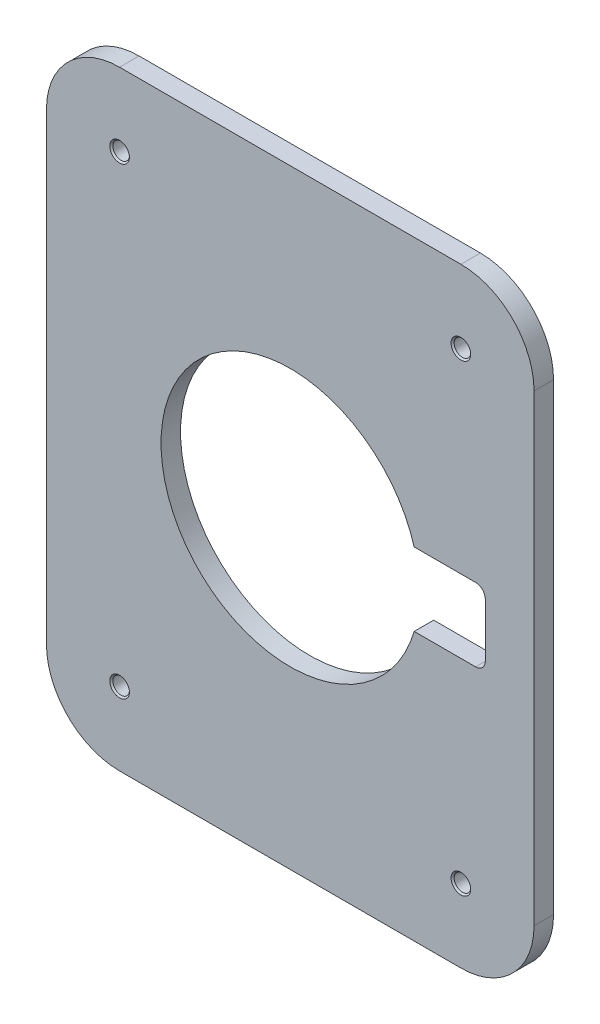
ISO-10303-21;
HEADER;
FILE_DESCRIPTION(('STEP AP214'),'2;1');
FILE_NAME('part.step','',(''),(''),'','','');
FILE_SCHEMA(('AUTOMOTIVE_DESIGN { 1 0 10303 214 1 1 1 1 }'));
ENDSEC;
DATA;
#1=APPLICATION_CONTEXT('core data for automotive mechanical design processes');
#2=APPLICATION_PROTOCOL_DEFINITION('international standard','automotive_design',2000,#1);
#3=PRODUCT_CONTEXT('',#1,'mechanical');
#4=PRODUCT('Part','Part','',(#3));
#5=PRODUCT_RELATED_PRODUCT_CATEGORY('part','',(#4));
#6=PRODUCT_DEFINITION_FORMATION('','',#4);
#7=PRODUCT_DEFINITION_CONTEXT('part definition',#1,'design');
#8=PRODUCT_DEFINITION('design','',#6,#7);
#9=PRODUCT_DEFINITION_SHAPE('','',#8);
#10=(LENGTH_UNIT() NAMED_UNIT(*) SI_UNIT(.MILLI.,.METRE.));
#11=(NAMED_UNIT(*) PLANE_ANGLE_UNIT() SI_UNIT($,.RADIAN.));
#12=(NAMED_UNIT(*) SI_UNIT($,.STERADIAN.) SOLID_ANGLE_UNIT());
#13=UNCERTAINTY_MEASURE_WITH_UNIT(LENGTH_MEASURE(1.E-05),#10,'distance_accuracy_value','');
#14=(GEOMETRIC_REPRESENTATION_CONTEXT(3) GLOBAL_UNCERTAINTY_ASSIGNED_CONTEXT((#13)) GLOBAL_UNIT_ASSIGNED_CONTEXT((#10,
#11,#12)) REPRESENTATION_CONTEXT('',''));
#15=CARTESIAN_POINT('',(0.,0.,0.));
#16=DIRECTION('',(0.,0.,1.));
#17=DIRECTION('',(1.,0.,0.));
#18=AXIS2_PLACEMENT_3D('',#15,#16,#17);
#19=CARTESIAN_POINT('',(0.,0.,0.));
#20=DIRECTION('',(0.,0.,1.));
#21=DIRECTION('',(1.,0.,0.));
#22=AXIS2_PLACEMENT_3D('',#19,#20,#21);
#23=PLANE('',#22);
#24=CARTESIAN_POINT('',(70.,95.,0.));
#25=DIRECTION('',(0.,0.,-1.));
#26=DIRECTION('',(-1.,0.,0.));
#27=AXIS2_PLACEMENT_3D('',#24,#25,#26);
#28=CIRCLE('',#27,4.025);
#29=CARTESIAN_POINT('',(65.975,95.,0.));
#30=VERTEX_POINT('',#29);
#31=EDGE_CURVE('E616',#30,#30,#28,.T.);
#32=ORIENTED_EDGE('',*,*,#31,.F.);
#33=EDGE_LOOP('',(#32));
#34=FACE_BOUND('',#33,.T.);
#35=CARTESIAN_POINT('',(-70.,95.,0.));
#36=DIRECTION('',(0.,0.,-1.));
#37=DIRECTION('',(-1.,0.,0.));
#38=AXIS2_PLACEMENT_3D('',#35,#36,#37);
#39=CIRCLE('',#38,4.025);
#40=CARTESIAN_POINT('',(-74.025,95.,0.));
#41=VERTEX_POINT('',#40);
#42=EDGE_CURVE('E634',#41,#41,#39,.T.);
#43=ORIENTED_EDGE('',*,*,#42,.F.);
#44=EDGE_LOOP('',(#43));
#45=FACE_BOUND('',#44,.T.);
#46=CARTESIAN_POINT('',(-70.,-95.,0.));
#47=DIRECTION('',(0.,0.,-1.));
#48=DIRECTION('',(-1.,0.,0.));
#49=AXIS2_PLACEMENT_3D('',#46,#47,#48);
#50=CIRCLE('',#49,4.025);
#51=CARTESIAN_POINT('',(-74.025,-95.,0.));
#52=VERTEX_POINT('',#51);
#53=EDGE_CURVE('E650',#52,#52,#50,.T.);
#54=ORIENTED_EDGE('',*,*,#53,.F.);
#55=EDGE_LOOP('',(#54));
#56=FACE_BOUND('',#55,.T.);
#57=DIRECTION('',(-1.,0.,0.));
#58=VECTOR('',#57,1.);
#59=CARTESIAN_POINT('',(-100.,125.,0.));
#60=LINE('',#59,#58);
#61=CARTESIAN_POINT('',(70.,125.,0.));
#62=VERTEX_POINT('',#61);
#63=CARTESIAN_POINT('',(-70.,125.,0.));
#64=VERTEX_POINT('',#63);
#65=EDGE_CURVE('E219',#62,#64,#60,.T.);
#66=ORIENTED_EDGE('',*,*,#65,.F.);
#67=CARTESIAN_POINT('',(70.,95.,0.));
#68=DIRECTION('',(0.,0.,1.));
#69=DIRECTION('',(1.,0.,0.));
#70=AXIS2_PLACEMENT_3D('',#67,#68,#69);
#71=CIRCLE('',#70,30.);
#72=CARTESIAN_POINT('',(100.,95.,0.));
#73=VERTEX_POINT('',#72);
#74=EDGE_CURVE('E245',#62,#73,#71,.F.);
#75=ORIENTED_EDGE('',*,*,#74,.T.);
#76=DIRECTION('',(0.,1.,0.));
#77=VECTOR('',#76,1.);
#78=CARTESIAN_POINT('',(100.,125.,0.));
#79=LINE('',#78,#77);
#80=CARTESIAN_POINT('',(100.,-95.,0.));
#81=VERTEX_POINT('',#80);
#82=EDGE_CURVE('E168',#81,#73,#79,.T.);
#83=ORIENTED_EDGE('',*,*,#82,.F.);
#84=CARTESIAN_POINT('',(70.,-95.,0.));
#85=DIRECTION('',(0.,0.,1.));
#86=DIRECTION('',(1.,0.,0.));
#87=AXIS2_PLACEMENT_3D('',#84,#85,#86);
#88=CIRCLE('',#87,30.);
#89=CARTESIAN_POINT('',(70.,-125.,0.));
#90=VERTEX_POINT('',#89);
#91=EDGE_CURVE('E236',#81,#90,#88,.F.);
#92=ORIENTED_EDGE('',*,*,#91,.T.);
#93=DIRECTION('',(1.,0.,0.));
#94=VECTOR('',#93,1.);
#95=CARTESIAN_POINT('',(-100.,-125.,0.));
#96=LINE('',#95,#94);
#97=CARTESIAN_POINT('',(-70.,-125.,0.));
#98=VERTEX_POINT('',#97);
#99=EDGE_CURVE('E203',#98,#90,#96,.T.);
#100=ORIENTED_EDGE('',*,*,#99,.F.);
#101=CARTESIAN_POINT('',(-70.,-95.,0.));
#102=DIRECTION('',(0.,0.,1.));
#103=DIRECTION('',(1.,0.,0.));
#104=AXIS2_PLACEMENT_3D('',#101,#102,#103);
#105=CIRCLE('',#104,30.);
#106=CARTESIAN_POINT('',(-100.,-95.,0.));
#107=VERTEX_POINT('',#106);
#108=EDGE_CURVE('E239',#98,#107,#105,.F.);
#109=ORIENTED_EDGE('',*,*,#108,.T.);
#110=DIRECTION('',(0.,-1.,0.));
#111=VECTOR('',#110,1.);
#112=CARTESIAN_POINT('',(-100.,125.,0.));
#113=LINE('',#112,#111);
#114=CARTESIAN_POINT('',(-100.,95.,0.));
#115=VERTEX_POINT('',#114);
#116=EDGE_CURVE('E223',#115,#107,#113,.T.);
#117=ORIENTED_EDGE('',*,*,#116,.F.);
#118=CARTESIAN_POINT('',(-70.,95.,0.));
#119=DIRECTION('',(0.,0.,1.));
#120=DIRECTION('',(1.,0.,0.));
#121=AXIS2_PLACEMENT_3D('',#118,#119,#120);
#122=CIRCLE('',#121,30.);
#123=EDGE_CURVE('E242',#115,#64,#122,.F.);
#124=ORIENTED_EDGE('',*,*,#123,.T.);
#125=EDGE_LOOP('',(#66,#75,#83,#92,#100,#109,#117,#124));
#126=FACE_BOUND('',#125,.T.);
#127=CARTESIAN_POINT('',(0.,0.,0.));
#128=DIRECTION('',(0.,0.,1.));
#129=DIRECTION('',(1.,0.,0.));
#130=AXIS2_PLACEMENT_3D('',#127,#128,#129);
#131=CIRCLE('',#130,53.);
#132=CARTESIAN_POINT('',(50.8330601085554,15.,0.));
#133=VERTEX_POINT('',#132);
#134=CARTESIAN_POINT('',(50.8330601085554,-15.,0.));
#135=VERTEX_POINT('',#134);
#136=EDGE_CURVE('E185',#133,#135,#131,.T.);
#137=ORIENTED_EDGE('',*,*,#136,.T.);
#138=DIRECTION('',(1.,0.,0.));
#139=VECTOR('',#138,1.);
#140=CARTESIAN_POINT('',(80.,-15.,0.));
#141=LINE('',#140,#139);
#142=CARTESIAN_POINT('',(76.,-15.,0.));
#143=VERTEX_POINT('',#142);
#144=EDGE_CURVE('E166',#135,#143,#141,.T.);
#145=ORIENTED_EDGE('',*,*,#144,.T.);
#146=CARTESIAN_POINT('',(76.,-11.,0.));
#147=DIRECTION('',(0.,0.,1.));
#148=DIRECTION('',(1.,0.,0.));
#149=AXIS2_PLACEMENT_3D('',#146,#147,#148);
#150=CIRCLE('',#149,4.);
#151=CARTESIAN_POINT('',(80.,-11.,0.));
#152=VERTEX_POINT('',#151);
#153=EDGE_CURVE('E293',#143,#152,#150,.T.);
#154=ORIENTED_EDGE('',*,*,#153,.T.);
#155=DIRECTION('',(0.,1.,0.));
#156=VECTOR('',#155,1.);
#157=CARTESIAN_POINT('',(80.,15.,0.));
#158=LINE('',#157,#156);
#159=CARTESIAN_POINT('',(80.,11.,0.));
#160=VERTEX_POINT('',#159);
#161=EDGE_CURVE('E191',#152,#160,#158,.T.);
#162=ORIENTED_EDGE('',*,*,#161,.T.);
#163=CARTESIAN_POINT('',(76.,11.,0.));
#164=DIRECTION('',(0.,0.,1.));
#165=DIRECTION('',(1.,0.,0.));
#166=AXIS2_PLACEMENT_3D('',#163,#164,#165);
#167=CIRCLE('',#166,4.);
#168=CARTESIAN_POINT('',(76.,15.,0.));
#169=VERTEX_POINT('',#168);
#170=EDGE_CURVE('E54',#160,#169,#167,.T.);
#171=ORIENTED_EDGE('',*,*,#170,.T.);
#172=DIRECTION('',(-1.,0.,0.));
#173=VECTOR('',#172,1.);
#174=CARTESIAN_POINT('',(50.8330601085554,15.,0.));
#175=LINE('',#174,#173);
#176=EDGE_CURVE('E158',#169,#133,#175,.T.);
#177=ORIENTED_EDGE('',*,*,#176,.T.);
#178=EDGE_LOOP('',(#137,#145,#154,#162,#171,#177));
#179=FACE_BOUND('',#178,.T.);
#180=CARTESIAN_POINT('',(70.,-95.,0.));
#181=DIRECTION('',(0.,0.,-1.));
#182=DIRECTION('',(-1.,0.,0.));
#183=AXIS2_PLACEMENT_3D('',#180,#181,#182);
#184=CIRCLE('',#183,4.025);
#185=CARTESIAN_POINT('',(65.975,-95.,0.));
#186=VERTEX_POINT('',#185);
#187=EDGE_CURVE('E666',#186,#186,#184,.T.);
#188=ORIENTED_EDGE('',*,*,#187,.F.);
#189=EDGE_LOOP('',(#188));
#190=FACE_BOUND('',#189,.T.);
#191=ADVANCED_FACE('F45',(#34,#45,#56,#126,#179,#190),#23,.F.);
#192=CARTESIAN_POINT('',(0.,0.,8.));
#193=DIRECTION('',(0.,0.,1.));
#194=DIRECTION('',(1.,0.,0.));
#195=AXIS2_PLACEMENT_3D('',#192,#193,#194);
#196=PLANE('',#195);
#197=CARTESIAN_POINT('',(70.,95.,8.));
#198=DIRECTION('',(0.,0.,-1.));
#199=DIRECTION('',(-1.,0.,0.));
#200=AXIS2_PLACEMENT_3D('',#197,#198,#199);
#201=CIRCLE('',#200,4.025);
#202=CARTESIAN_POINT('',(65.975,95.,8.));
#203=VERTEX_POINT('',#202);
#204=EDGE_CURVE('E618',#203,#203,#201,.T.);
#205=ORIENTED_EDGE('',*,*,#204,.T.);
#206=EDGE_LOOP('',(#205));
#207=FACE_BOUND('',#206,.T.);
#208=CARTESIAN_POINT('',(-70.,95.,8.));
#209=DIRECTION('',(0.,0.,-1.));
#210=DIRECTION('',(-1.,0.,0.));
#211=AXIS2_PLACEMENT_3D('',#208,#209,#210);
#212=CIRCLE('',#211,4.025);
#213=CARTESIAN_POINT('',(-74.025,95.,8.));
#214=VERTEX_POINT('',#213);
#215=EDGE_CURVE('E630',#214,#214,#212,.T.);
#216=ORIENTED_EDGE('',*,*,#215,.T.);
#217=EDGE_LOOP('',(#216));
#218=FACE_BOUND('',#217,.T.);
#219=CARTESIAN_POINT('',(-70.,-95.,8.));
#220=DIRECTION('',(0.,0.,-1.));
#221=DIRECTION('',(-1.,0.,0.));
#222=AXIS2_PLACEMENT_3D('',#219,#220,#221);
#223=CIRCLE('',#222,4.025);
#224=CARTESIAN_POINT('',(-74.025,-95.,8.));
#225=VERTEX_POINT('',#224);
#226=EDGE_CURVE('E646',#225,#225,#223,.T.);
#227=ORIENTED_EDGE('',*,*,#226,.T.);
#228=EDGE_LOOP('',(#227));
#229=FACE_BOUND('',#228,.T.);
#230=CARTESIAN_POINT('',(70.,-95.,8.));
#231=DIRECTION('',(0.,0.,-1.));
#232=DIRECTION('',(-1.,0.,0.));
#233=AXIS2_PLACEMENT_3D('',#230,#231,#232);
#234=CIRCLE('',#233,4.025);
#235=CARTESIAN_POINT('',(65.975,-95.,8.));
#236=VERTEX_POINT('',#235);
#237=EDGE_CURVE('E662',#236,#236,#234,.T.);
#238=ORIENTED_EDGE('',*,*,#237,.T.);
#239=EDGE_LOOP('',(#238));
#240=FACE_BOUND('',#239,.T.);
#241=DIRECTION('',(0.,1.,0.));
#242=VECTOR('',#241,1.);
#243=CARTESIAN_POINT('',(100.,125.,8.));
#244=LINE('',#243,#242);
#245=CARTESIAN_POINT('',(100.,-95.,8.));
#246=VERTEX_POINT('',#245);
#247=CARTESIAN_POINT('',(100.,95.,8.));
#248=VERTEX_POINT('',#247);
#249=EDGE_CURVE('E198',#246,#248,#244,.T.);
#250=ORIENTED_EDGE('',*,*,#249,.T.);
#251=CARTESIAN_POINT('',(70.,95.,8.));
#252=DIRECTION('',(0.,0.,1.));
#253=DIRECTION('',(1.,0.,0.));
#254=AXIS2_PLACEMENT_3D('',#251,#252,#253);
#255=CIRCLE('',#254,30.);
#256=CARTESIAN_POINT('',(70.,125.,8.));
#257=VERTEX_POINT('',#256);
#258=EDGE_CURVE('E264',#248,#257,#255,.T.);
#259=ORIENTED_EDGE('',*,*,#258,.T.);
#260=DIRECTION('',(-1.,0.,0.));
#261=VECTOR('',#260,1.);
#262=CARTESIAN_POINT('',(-100.,125.,8.));
#263=LINE('',#262,#261);
#264=CARTESIAN_POINT('',(-70.,125.,8.));
#265=VERTEX_POINT('',#264);
#266=EDGE_CURVE('E202',#257,#265,#263,.T.);
#267=ORIENTED_EDGE('',*,*,#266,.T.);
#268=CARTESIAN_POINT('',(-70.,95.,8.));
#269=DIRECTION('',(0.,0.,1.));
#270=DIRECTION('',(1.,0.,0.));
#271=AXIS2_PLACEMENT_3D('',#268,#269,#270);
#272=CIRCLE('',#271,30.);
#273=CARTESIAN_POINT('',(-100.,95.,8.));
#274=VERTEX_POINT('',#273);
#275=EDGE_CURVE('E261',#265,#274,#272,.T.);
#276=ORIENTED_EDGE('',*,*,#275,.T.);
#277=DIRECTION('',(0.,-1.,0.));
#278=VECTOR('',#277,1.);
#279=CARTESIAN_POINT('',(-100.,125.,8.));
#280=LINE('',#279,#278);
#281=CARTESIAN_POINT('',(-100.,-95.,8.));
#282=VERTEX_POINT('',#281);
#283=EDGE_CURVE('E207',#274,#282,#280,.T.);
#284=ORIENTED_EDGE('',*,*,#283,.T.);
#285=CARTESIAN_POINT('',(-70.,-95.,8.));
#286=DIRECTION('',(0.,0.,1.));
#287=DIRECTION('',(1.,0.,0.));
#288=AXIS2_PLACEMENT_3D('',#285,#286,#287);
#289=CIRCLE('',#288,30.);
#290=CARTESIAN_POINT('',(-70.,-125.,8.));
#291=VERTEX_POINT('',#290);
#292=EDGE_CURVE('E258',#282,#291,#289,.T.);
#293=ORIENTED_EDGE('',*,*,#292,.T.);
#294=DIRECTION('',(1.,0.,0.));
#295=VECTOR('',#294,1.);
#296=CARTESIAN_POINT('',(-100.,-125.,8.));
#297=LINE('',#296,#295);
#298=CARTESIAN_POINT('',(70.,-125.,8.));
#299=VERTEX_POINT('',#298);
#300=EDGE_CURVE('E211',#291,#299,#297,.T.);
#301=ORIENTED_EDGE('',*,*,#300,.T.);
#302=CARTESIAN_POINT('',(70.,-95.,8.));
#303=DIRECTION('',(0.,0.,1.));
#304=DIRECTION('',(1.,0.,0.));
#305=AXIS2_PLACEMENT_3D('',#302,#303,#304);
#306=CIRCLE('',#305,30.);
#307=EDGE_CURVE('E255',#299,#246,#306,.T.);
#308=ORIENTED_EDGE('',*,*,#307,.T.);
#309=EDGE_LOOP('',(#250,#259,#267,#276,#284,#293,#301,#308));
#310=FACE_BOUND('',#309,.T.);
#311=DIRECTION('',(1.,0.,0.));
#312=VECTOR('',#311,1.);
#313=CARTESIAN_POINT('',(80.,-15.,8.));
#314=LINE('',#313,#312);
#315=CARTESIAN_POINT('',(50.8330601085554,-15.,8.));
#316=VERTEX_POINT('',#315);
#317=CARTESIAN_POINT('',(76.,-15.,8.));
#318=VERTEX_POINT('',#317);
#319=EDGE_CURVE('E157',#316,#318,#314,.T.);
#320=ORIENTED_EDGE('',*,*,#319,.F.);
#321=CARTESIAN_POINT('',(0.,0.,8.));
#322=DIRECTION('',(0.,0.,1.));
#323=DIRECTION('',(1.,0.,0.));
#324=AXIS2_PLACEMENT_3D('',#321,#322,#323);
#325=CIRCLE('',#324,53.);
#326=CARTESIAN_POINT('',(50.8330601085554,15.,8.));
#327=VERTEX_POINT('',#326);
#328=EDGE_CURVE('E146',#327,#316,#325,.T.);
#329=ORIENTED_EDGE('',*,*,#328,.F.);
#330=DIRECTION('',(-1.,0.,0.));
#331=VECTOR('',#330,1.);
#332=CARTESIAN_POINT('',(50.8330601085554,15.,8.));
#333=LINE('',#332,#331);
#334=CARTESIAN_POINT('',(76.,15.,8.));
#335=VERTEX_POINT('',#334);
#336=EDGE_CURVE('E179',#335,#327,#333,.T.);
#337=ORIENTED_EDGE('',*,*,#336,.F.);
#338=CARTESIAN_POINT('',(76.,11.,8.));
#339=DIRECTION('',(0.,0.,1.));
#340=DIRECTION('',(1.,0.,0.));
#341=AXIS2_PLACEMENT_3D('',#338,#339,#340);
#342=CIRCLE('',#341,4.);
#343=CARTESIAN_POINT('',(80.,11.,8.));
#344=VERTEX_POINT('',#343);
#345=EDGE_CURVE('E11',#335,#344,#342,.F.);
#346=ORIENTED_EDGE('',*,*,#345,.T.);
#347=DIRECTION('',(0.,1.,0.));
#348=VECTOR('',#347,1.);
#349=CARTESIAN_POINT('',(80.,15.,8.));
#350=LINE('',#349,#348);
#351=CARTESIAN_POINT('',(80.,-11.,8.));
#352=VERTEX_POINT('',#351);
#353=EDGE_CURVE('E175',#352,#344,#350,.T.);
#354=ORIENTED_EDGE('',*,*,#353,.F.);
#355=CARTESIAN_POINT('',(76.,-11.,8.));
#356=DIRECTION('',(0.,0.,1.));
#357=DIRECTION('',(1.,0.,0.));
#358=AXIS2_PLACEMENT_3D('',#355,#356,#357);
#359=CIRCLE('',#358,4.);
#360=EDGE_CURVE('E173',#352,#318,#359,.F.);
#361=ORIENTED_EDGE('',*,*,#360,.T.);
#362=EDGE_LOOP('',(#320,#329,#337,#346,#354,#361));
#363=FACE_BOUND('',#362,.T.);
#364=ADVANCED_FACE('F170',(#207,#218,#229,#240,#310,#363),#196,.T.);
#365=CARTESIAN_POINT('',(100.,125.,8.));
#366=DIRECTION('',(-1.,0.,0.));
#367=DIRECTION('',(0.,-1.,0.));
#368=AXIS2_PLACEMENT_3D('',#365,#366,#367);
#369=PLANE('',#368);
#370=ORIENTED_EDGE('',*,*,#82,.T.);
#371=DIRECTION('',(0.,0.,-1.));
#372=VECTOR('',#371,1.);
#373=CARTESIAN_POINT('',(100.,95.,8.));
#374=LINE('',#373,#372);
#375=EDGE_CURVE('E252',#73,#248,#374,.F.);
#376=ORIENTED_EDGE('',*,*,#375,.T.);
#377=ORIENTED_EDGE('',*,*,#249,.F.);
#378=DIRECTION('',(0.,0.,-1.));
#379=VECTOR('',#378,1.);
#380=CARTESIAN_POINT('',(100.,-95.,8.));
#381=LINE('',#380,#379);
#382=EDGE_CURVE('E248',#246,#81,#381,.T.);
#383=ORIENTED_EDGE('',*,*,#382,.T.);
#384=EDGE_LOOP('',(#370,#376,#377,#383));
#385=FACE_BOUND('',#384,.T.);
#386=ADVANCED_FACE('F323',(#385),#369,.F.);
#387=CARTESIAN_POINT('',(-100.,125.,8.));
#388=DIRECTION('',(0.,-1.,0.));
#389=DIRECTION('',(0.,0.,-1.));
#390=AXIS2_PLACEMENT_3D('',#387,#388,#389);
#391=PLANE('',#390);
#392=ORIENTED_EDGE('',*,*,#266,.F.);
#393=DIRECTION('',(0.,0.,-1.));
#394=VECTOR('',#393,1.);
#395=CARTESIAN_POINT('',(70.,125.,8.));
#396=LINE('',#395,#394);
#397=EDGE_CURVE('E232',#257,#62,#396,.T.);
#398=ORIENTED_EDGE('',*,*,#397,.T.);
#399=ORIENTED_EDGE('',*,*,#65,.T.);
#400=DIRECTION('',(0.,0.,-1.));
#401=VECTOR('',#400,1.);
#402=CARTESIAN_POINT('',(-70.,125.,8.));
#403=LINE('',#402,#401);
#404=EDGE_CURVE('E215',#64,#265,#403,.F.);
#405=ORIENTED_EDGE('',*,*,#404,.T.);
#406=EDGE_LOOP('',(#392,#398,#399,#405));
#407=FACE_BOUND('',#406,.T.);
#408=ADVANCED_FACE('F337',(#407),#391,.F.);
#409=CARTESIAN_POINT('',(-100.,125.,8.));
#410=DIRECTION('',(1.,0.,0.));
#411=DIRECTION('',(0.,1.,0.));
#412=AXIS2_PLACEMENT_3D('',#409,#410,#411);
#413=PLANE('',#412);
#414=ORIENTED_EDGE('',*,*,#283,.F.);
#415=DIRECTION('',(0.,0.,-1.));
#416=VECTOR('',#415,1.);
#417=CARTESIAN_POINT('',(-100.,95.,8.));
#418=LINE('',#417,#416);
#419=EDGE_CURVE('E270',#274,#115,#418,.T.);
#420=ORIENTED_EDGE('',*,*,#419,.T.);
#421=ORIENTED_EDGE('',*,*,#116,.T.);
#422=DIRECTION('',(0.,0.,-1.));
#423=VECTOR('',#422,1.);
#424=CARTESIAN_POINT('',(-100.,-95.,8.));
#425=LINE('',#424,#423);
#426=EDGE_CURVE('E267',#107,#282,#425,.F.);
#427=ORIENTED_EDGE('',*,*,#426,.T.);
#428=EDGE_LOOP('',(#414,#420,#421,#427));
#429=FACE_BOUND('',#428,.T.);
#430=ADVANCED_FACE('F333',(#429),#413,.F.);
#431=CARTESIAN_POINT('',(-100.,-125.,8.));
#432=DIRECTION('',(0.,1.,0.));
#433=DIRECTION('',(0.,0.,1.));
#434=AXIS2_PLACEMENT_3D('',#431,#432,#433);
#435=PLANE('',#434);
#436=ORIENTED_EDGE('',*,*,#300,.F.);
#437=DIRECTION('',(0.,0.,-1.));
#438=VECTOR('',#437,1.);
#439=CARTESIAN_POINT('',(-70.,-125.,8.));
#440=LINE('',#439,#438);
#441=EDGE_CURVE('E277',#291,#98,#440,.T.);
#442=ORIENTED_EDGE('',*,*,#441,.T.);
#443=ORIENTED_EDGE('',*,*,#99,.T.);
#444=DIRECTION('',(0.,0.,-1.));
#445=VECTOR('',#444,1.);
#446=CARTESIAN_POINT('',(70.,-125.,8.));
#447=LINE('',#446,#445);
#448=EDGE_CURVE('E274',#90,#299,#447,.F.);
#449=ORIENTED_EDGE('',*,*,#448,.T.);
#450=EDGE_LOOP('',(#436,#442,#443,#449));
#451=FACE_BOUND('',#450,.T.);
#452=ADVANCED_FACE('F330',(#451),#435,.F.);
#453=CARTESIAN_POINT('',(0.,0.,8.));
#454=DIRECTION('',(0.,0.,-1.));
#455=DIRECTION('',(-1.,0.,0.));
#456=AXIS2_PLACEMENT_3D('',#453,#454,#455);
#457=CYLINDRICAL_SURFACE('',#456,53.);
#458=ORIENTED_EDGE('',*,*,#136,.F.);
#459=DIRECTION('',(0.,0.,-1.));
#460=VECTOR('',#459,1.);
#461=CARTESIAN_POINT('',(50.8330601085554,15.,8.));
#462=LINE('',#461,#460);
#463=EDGE_CURVE('E153',#327,#133,#462,.T.);
#464=ORIENTED_EDGE('',*,*,#463,.F.);
#465=ORIENTED_EDGE('',*,*,#328,.T.);
#466=DIRECTION('',(0.,0.,-1.));
#467=VECTOR('',#466,1.);
#468=CARTESIAN_POINT('',(50.8330601085554,-15.,8.));
#469=LINE('',#468,#467);
#470=EDGE_CURVE('E150',#316,#135,#469,.T.);
#471=ORIENTED_EDGE('',*,*,#470,.T.);
#472=EDGE_LOOP('',(#458,#464,#465,#471));
#473=FACE_BOUND('',#472,.T.);
#474=ADVANCED_FACE('F149',(#473),#457,.F.);
#475=CARTESIAN_POINT('',(80.,-15.,8.));
#476=DIRECTION('',(0.,1.,0.));
#477=DIRECTION('',(-1.,0.,0.));
#478=AXIS2_PLACEMENT_3D('',#475,#476,#477);
#479=PLANE('',#478);
#480=ORIENTED_EDGE('',*,*,#319,.T.);
#481=DIRECTION('',(0.,0.,-1.));
#482=VECTOR('',#481,1.);
#483=CARTESIAN_POINT('',(76.,-15.,0.));
#484=LINE('',#483,#482);
#485=EDGE_CURVE('E281',#318,#143,#484,.T.);
#486=ORIENTED_EDGE('',*,*,#485,.T.);
#487=ORIENTED_EDGE('',*,*,#144,.F.);
#488=ORIENTED_EDGE('',*,*,#470,.F.);
#489=EDGE_LOOP('',(#480,#486,#487,#488));
#490=FACE_BOUND('',#489,.T.);
#491=ADVANCED_FACE('F162',(#490),#479,.T.);
#492=CARTESIAN_POINT('',(80.,15.,8.));
#493=DIRECTION('',(-1.,0.,0.));
#494=DIRECTION('',(0.,0.,1.));
#495=AXIS2_PLACEMENT_3D('',#492,#493,#494);
#496=PLANE('',#495);
#497=ORIENTED_EDGE('',*,*,#161,.F.);
#498=DIRECTION('',(0.,0.,-1.));
#499=VECTOR('',#498,1.);
#500=CARTESIAN_POINT('',(80.,-11.,8.));
#501=LINE('',#500,#499);
#502=EDGE_CURVE('E288',#152,#352,#501,.F.);
#503=ORIENTED_EDGE('',*,*,#502,.T.);
#504=ORIENTED_EDGE('',*,*,#353,.T.);
#505=DIRECTION('',(0.,0.,-1.));
#506=VECTOR('',#505,1.);
#507=CARTESIAN_POINT('',(80.,11.,0.));
#508=LINE('',#507,#506);
#509=EDGE_CURVE('E284',#344,#160,#508,.T.);
#510=ORIENTED_EDGE('',*,*,#509,.T.);
#511=EDGE_LOOP('',(#497,#503,#504,#510));
#512=FACE_BOUND('',#511,.T.);
#513=ADVANCED_FACE('F303',(#512),#496,.T.);
#514=CARTESIAN_POINT('',(50.8330601085554,15.,8.));
#515=DIRECTION('',(0.,-1.,0.));
#516=DIRECTION('',(1.,0.,0.));
#517=AXIS2_PLACEMENT_3D('',#514,#515,#516);
#518=PLANE('',#517);
#519=ORIENTED_EDGE('',*,*,#176,.F.);
#520=DIRECTION('',(0.,0.,-1.));
#521=VECTOR('',#520,1.);
#522=CARTESIAN_POINT('',(76.,15.,8.));
#523=LINE('',#522,#521);
#524=EDGE_CURVE('E61',#169,#335,#523,.F.);
#525=ORIENTED_EDGE('',*,*,#524,.T.);
#526=ORIENTED_EDGE('',*,*,#336,.T.);
#527=ORIENTED_EDGE('',*,*,#463,.T.);
#528=EDGE_LOOP('',(#519,#525,#526,#527));
#529=FACE_BOUND('',#528,.T.);
#530=ADVANCED_FACE('F349',(#529),#518,.T.);
#531=CARTESIAN_POINT('',(70.,95.,8.));
#532=DIRECTION('',(0.,0.,-1.));
#533=DIRECTION('',(-1.,0.,0.));
#534=AXIS2_PLACEMENT_3D('',#531,#532,#533);
#535=CYLINDRICAL_SURFACE('',#534,30.);
#536=ORIENTED_EDGE('',*,*,#258,.F.);
#537=ORIENTED_EDGE('',*,*,#375,.F.);
#538=ORIENTED_EDGE('',*,*,#74,.F.);
#539=ORIENTED_EDGE('',*,*,#397,.F.);
#540=EDGE_LOOP('',(#536,#537,#538,#539));
#541=FACE_BOUND('',#540,.T.);
#542=ADVANCED_FACE('F345',(#541),#535,.T.);
#543=CARTESIAN_POINT('',(-70.,95.,8.));
#544=DIRECTION('',(0.,0.,-1.));
#545=DIRECTION('',(-1.,0.,0.));
#546=AXIS2_PLACEMENT_3D('',#543,#544,#545);
#547=CYLINDRICAL_SURFACE('',#546,30.);
#548=ORIENTED_EDGE('',*,*,#275,.F.);
#549=ORIENTED_EDGE('',*,*,#404,.F.);
#550=ORIENTED_EDGE('',*,*,#123,.F.);
#551=ORIENTED_EDGE('',*,*,#419,.F.);
#552=EDGE_LOOP('',(#548,#549,#550,#551));
#553=FACE_BOUND('',#552,.T.);
#554=ADVANCED_FACE('F348',(#553),#547,.T.);
#555=CARTESIAN_POINT('',(-70.,-95.,8.));
#556=DIRECTION('',(0.,0.,-1.));
#557=DIRECTION('',(-1.,0.,0.));
#558=AXIS2_PLACEMENT_3D('',#555,#556,#557);
#559=CYLINDRICAL_SURFACE('',#558,30.);
#560=ORIENTED_EDGE('',*,*,#292,.F.);
#561=ORIENTED_EDGE('',*,*,#426,.F.);
#562=ORIENTED_EDGE('',*,*,#108,.F.);
#563=ORIENTED_EDGE('',*,*,#441,.F.);
#564=EDGE_LOOP('',(#560,#561,#562,#563));
#565=FACE_BOUND('',#564,.T.);
#566=ADVANCED_FACE('F314',(#565),#559,.T.);
#567=CARTESIAN_POINT('',(70.,-95.,8.));
#568=DIRECTION('',(0.,0.,-1.));
#569=DIRECTION('',(-1.,0.,0.));
#570=AXIS2_PLACEMENT_3D('',#567,#568,#569);
#571=CYLINDRICAL_SURFACE('',#570,30.);
#572=ORIENTED_EDGE('',*,*,#307,.F.);
#573=ORIENTED_EDGE('',*,*,#448,.F.);
#574=ORIENTED_EDGE('',*,*,#91,.F.);
#575=ORIENTED_EDGE('',*,*,#382,.F.);
#576=EDGE_LOOP('',(#572,#573,#574,#575));
#577=FACE_BOUND('',#576,.T.);
#578=ADVANCED_FACE('F307',(#577),#571,.T.);
#579=CARTESIAN_POINT('',(76.,-11.,8.));
#580=DIRECTION('',(0.,0.,1.));
#581=DIRECTION('',(1.,0.,0.));
#582=AXIS2_PLACEMENT_3D('',#579,#580,#581);
#583=CYLINDRICAL_SURFACE('',#582,4.);
#584=ORIENTED_EDGE('',*,*,#360,.F.);
#585=ORIENTED_EDGE('',*,*,#502,.F.);
#586=ORIENTED_EDGE('',*,*,#153,.F.);
#587=ORIENTED_EDGE('',*,*,#485,.F.);
#588=EDGE_LOOP('',(#584,#585,#586,#587));
#589=FACE_BOUND('',#588,.T.);
#590=ADVANCED_FACE('F305',(#589),#583,.F.);
#591=CARTESIAN_POINT('',(76.,11.,8.));
#592=DIRECTION('',(0.,0.,1.));
#593=DIRECTION('',(1.,0.,0.));
#594=AXIS2_PLACEMENT_3D('',#591,#592,#593);
#595=CYLINDRICAL_SURFACE('',#594,4.);
#596=ORIENTED_EDGE('',*,*,#345,.F.);
#597=ORIENTED_EDGE('',*,*,#524,.F.);
#598=ORIENTED_EDGE('',*,*,#170,.F.);
#599=ORIENTED_EDGE('',*,*,#509,.F.);
#600=EDGE_LOOP('',(#596,#597,#598,#599));
#601=FACE_BOUND('',#600,.T.);
#602=ADVANCED_FACE('F47',(#601),#595,.F.);
#603=CARTESIAN_POINT('',(70.,-95.,7.375));
#604=DIRECTION('',(0.,0.,1.));
#605=DIRECTION('',(1.,0.,0.));
#606=AXIS2_PLACEMENT_3D('',#603,#604,#605);
#607=CONICAL_SURFACE('',#606,3.4,0.785398163397451);
#608=ORIENTED_EDGE('',*,*,#237,.F.);
#609=EDGE_LOOP('',(#608));
#610=FACE_BOUND('',#609,.T.);
#611=CARTESIAN_POINT('',(70.,-95.,7.375));
#612=DIRECTION('',(0.,0.,-1.));
#613=DIRECTION('',(-1.,0.,0.));
#614=AXIS2_PLACEMENT_3D('',#611,#612,#613);
#615=CIRCLE('',#614,3.4);
#616=CARTESIAN_POINT('',(66.6,-95.,7.375));
#617=VERTEX_POINT('',#616);
#618=EDGE_CURVE('E188',#617,#617,#615,.T.);
#619=ORIENTED_EDGE('',*,*,#618,.T.);
#620=EDGE_LOOP('',(#619));
#621=FACE_BOUND('',#620,.T.);
#622=ADVANCED_FACE('F312',(#610,#621),#607,.F.);
#623=CARTESIAN_POINT('',(70.,-95.,0.));
#624=DIRECTION('',(0.,0.,-1.));
#625=DIRECTION('',(-1.,0.,0.));
#626=AXIS2_PLACEMENT_3D('',#623,#624,#625);
#627=CYLINDRICAL_SURFACE('',#626,3.4);
#628=ORIENTED_EDGE('',*,*,#618,.F.);
#629=EDGE_LOOP('',(#628));
#630=FACE_BOUND('',#629,.T.);
#631=CARTESIAN_POINT('',(70.,-95.,0.625000000000008));
#632=DIRECTION('',(0.,0.,-1.));
#633=DIRECTION('',(-1.,0.,0.));
#634=AXIS2_PLACEMENT_3D('',#631,#632,#633);
#635=CIRCLE('',#634,3.4);
#636=CARTESIAN_POINT('',(66.6,-95.,0.625000000000008));
#637=VERTEX_POINT('',#636);
#638=EDGE_CURVE('E670',#637,#637,#635,.T.);
#639=ORIENTED_EDGE('',*,*,#638,.T.);
#640=EDGE_LOOP('',(#639));
#641=FACE_BOUND('',#640,.T.);
#642=ADVANCED_FACE('F443',(#630,#641),#627,.F.);
#643=CARTESIAN_POINT('',(70.,-95.,0.));
#644=DIRECTION('',(0.,0.,-1.));
#645=DIRECTION('',(-1.,0.,0.));
#646=AXIS2_PLACEMENT_3D('',#643,#644,#645);
#647=CONICAL_SURFACE('',#646,4.025,0.785398163397442);
#648=ORIENTED_EDGE('',*,*,#638,.F.);
#649=EDGE_LOOP('',(#648));
#650=FACE_BOUND('',#649,.T.);
#651=ORIENTED_EDGE('',*,*,#187,.T.);
#652=EDGE_LOOP('',(#651));
#653=FACE_BOUND('',#652,.T.);
#654=ADVANCED_FACE('F454',(#650,#653),#647,.F.);
#655=CARTESIAN_POINT('',(-70.,-95.,7.375));
#656=DIRECTION('',(0.,0.,1.));
#657=DIRECTION('',(1.,0.,0.));
#658=AXIS2_PLACEMENT_3D('',#655,#656,#657);
#659=CONICAL_SURFACE('',#658,3.4,0.785398163397451);
#660=ORIENTED_EDGE('',*,*,#226,.F.);
#661=EDGE_LOOP('',(#660));
#662=FACE_BOUND('',#661,.T.);
#663=CARTESIAN_POINT('',(-70.,-95.,7.375));
#664=DIRECTION('',(0.,0.,-1.));
#665=DIRECTION('',(-1.,0.,0.));
#666=AXIS2_PLACEMENT_3D('',#663,#664,#665);
#667=CIRCLE('',#666,3.4);
#668=CARTESIAN_POINT('',(-73.4,-95.,7.375));
#669=VERTEX_POINT('',#668);
#670=EDGE_CURVE('E658',#669,#669,#667,.T.);
#671=ORIENTED_EDGE('',*,*,#670,.T.);
#672=EDGE_LOOP('',(#671));
#673=FACE_BOUND('',#672,.T.);
#674=ADVANCED_FACE('F467',(#662,#673),#659,.F.);
#675=CARTESIAN_POINT('',(-70.,-95.,0.));
#676=DIRECTION('',(0.,0.,-1.));
#677=DIRECTION('',(-1.,0.,0.));
#678=AXIS2_PLACEMENT_3D('',#675,#676,#677);
#679=CYLINDRICAL_SURFACE('',#678,3.4);
#680=ORIENTED_EDGE('',*,*,#670,.F.);
#681=EDGE_LOOP('',(#680));
#682=FACE_BOUND('',#681,.T.);
#683=CARTESIAN_POINT('',(-70.,-95.,0.625000000000008));
#684=DIRECTION('',(0.,0.,-1.));
#685=DIRECTION('',(-1.,0.,0.));
#686=AXIS2_PLACEMENT_3D('',#683,#684,#685);
#687=CIRCLE('',#686,3.4);
#688=CARTESIAN_POINT('',(-73.4,-95.,0.625000000000008));
#689=VERTEX_POINT('',#688);
#690=EDGE_CURVE('E654',#689,#689,#687,.T.);
#691=ORIENTED_EDGE('',*,*,#690,.T.);
#692=EDGE_LOOP('',(#691));
#693=FACE_BOUND('',#692,.T.);
#694=ADVANCED_FACE('F478',(#682,#693),#679,.F.);
#695=CARTESIAN_POINT('',(-70.,-95.,0.));
#696=DIRECTION('',(0.,0.,-1.));
#697=DIRECTION('',(-1.,0.,0.));
#698=AXIS2_PLACEMENT_3D('',#695,#696,#697);
#699=CONICAL_SURFACE('',#698,4.025,0.785398163397442);
#700=ORIENTED_EDGE('',*,*,#690,.F.);
#701=EDGE_LOOP('',(#700));
#702=FACE_BOUND('',#701,.T.);
#703=ORIENTED_EDGE('',*,*,#53,.T.);
#704=EDGE_LOOP('',(#703));
#705=FACE_BOUND('',#704,.T.);
#706=ADVANCED_FACE('F488',(#702,#705),#699,.F.);
#707=CARTESIAN_POINT('',(-70.,95.,7.375));
#708=DIRECTION('',(0.,0.,1.));
#709=DIRECTION('',(1.,0.,0.));
#710=AXIS2_PLACEMENT_3D('',#707,#708,#709);
#711=CONICAL_SURFACE('',#710,3.4,0.785398163397451);
#712=ORIENTED_EDGE('',*,*,#215,.F.);
#713=EDGE_LOOP('',(#712));
#714=FACE_BOUND('',#713,.T.);
#715=CARTESIAN_POINT('',(-70.,95.,7.375));
#716=DIRECTION('',(0.,0.,-1.));
#717=DIRECTION('',(-1.,0.,0.));
#718=AXIS2_PLACEMENT_3D('',#715,#716,#717);
#719=CIRCLE('',#718,3.4);
#720=CARTESIAN_POINT('',(-73.4,95.,7.375));
#721=VERTEX_POINT('',#720);
#722=EDGE_CURVE('E642',#721,#721,#719,.T.);
#723=ORIENTED_EDGE('',*,*,#722,.T.);
#724=EDGE_LOOP('',(#723));
#725=FACE_BOUND('',#724,.T.);
#726=ADVANCED_FACE('F500',(#714,#725),#711,.F.);
#727=CARTESIAN_POINT('',(-70.,95.,0.));
#728=DIRECTION('',(0.,0.,-1.));
#729=DIRECTION('',(-1.,0.,0.));
#730=AXIS2_PLACEMENT_3D('',#727,#728,#729);
#731=CYLINDRICAL_SURFACE('',#730,3.4);
#732=ORIENTED_EDGE('',*,*,#722,.F.);
#733=EDGE_LOOP('',(#732));
#734=FACE_BOUND('',#733,.T.);
#735=CARTESIAN_POINT('',(-70.,95.,0.625000000000008));
#736=DIRECTION('',(0.,0.,-1.));
#737=DIRECTION('',(-1.,0.,0.));
#738=AXIS2_PLACEMENT_3D('',#735,#736,#737);
#739=CIRCLE('',#738,3.4);
#740=CARTESIAN_POINT('',(-73.4,95.,0.625000000000008));
#741=VERTEX_POINT('',#740);
#742=EDGE_CURVE('E638',#741,#741,#739,.T.);
#743=ORIENTED_EDGE('',*,*,#742,.T.);
#744=EDGE_LOOP('',(#743));
#745=FACE_BOUND('',#744,.T.);
#746=ADVANCED_FACE('F511',(#734,#745),#731,.F.);
#747=CARTESIAN_POINT('',(-70.,95.,0.));
#748=DIRECTION('',(0.,0.,-1.));
#749=DIRECTION('',(-1.,0.,0.));
#750=AXIS2_PLACEMENT_3D('',#747,#748,#749);
#751=CONICAL_SURFACE('',#750,4.025,0.785398163397442);
#752=ORIENTED_EDGE('',*,*,#742,.F.);
#753=EDGE_LOOP('',(#752));
#754=FACE_BOUND('',#753,.T.);
#755=ORIENTED_EDGE('',*,*,#42,.T.);
#756=EDGE_LOOP('',(#755));
#757=FACE_BOUND('',#756,.T.);
#758=ADVANCED_FACE('F521',(#754,#757),#751,.F.);
#759=CARTESIAN_POINT('',(70.,95.,7.375));
#760=DIRECTION('',(0.,0.,1.));
#761=DIRECTION('',(1.,0.,0.));
#762=AXIS2_PLACEMENT_3D('',#759,#760,#761);
#763=CONICAL_SURFACE('',#762,3.4,0.785398163397451);
#764=ORIENTED_EDGE('',*,*,#204,.F.);
#765=EDGE_LOOP('',(#764));
#766=FACE_BOUND('',#765,.T.);
#767=CARTESIAN_POINT('',(70.,95.,7.375));
#768=DIRECTION('',(0.,0.,-1.));
#769=DIRECTION('',(-1.,0.,0.));
#770=AXIS2_PLACEMENT_3D('',#767,#768,#769);
#771=CIRCLE('',#770,3.4);
#772=CARTESIAN_POINT('',(66.6,95.,7.375));
#773=VERTEX_POINT('',#772);
#774=EDGE_CURVE('E622',#773,#773,#771,.T.);
#775=ORIENTED_EDGE('',*,*,#774,.T.);
#776=EDGE_LOOP('',(#775));
#777=FACE_BOUND('',#776,.T.);
#778=ADVANCED_FACE('F533',(#766,#777),#763,.F.);
#779=CARTESIAN_POINT('',(70.,95.,0.));
#780=DIRECTION('',(0.,0.,-1.));
#781=DIRECTION('',(-1.,0.,0.));
#782=AXIS2_PLACEMENT_3D('',#779,#780,#781);
#783=CYLINDRICAL_SURFACE('',#782,3.4);
#784=ORIENTED_EDGE('',*,*,#774,.F.);
#785=EDGE_LOOP('',(#784));
#786=FACE_BOUND('',#785,.T.);
#787=CARTESIAN_POINT('',(70.,95.,0.625000000000008));
#788=DIRECTION('',(0.,0.,-1.));
#789=DIRECTION('',(-1.,0.,0.));
#790=AXIS2_PLACEMENT_3D('',#787,#788,#789);
#791=CIRCLE('',#790,3.4);
#792=CARTESIAN_POINT('',(66.6,95.,0.625000000000008));
#793=VERTEX_POINT('',#792);
#794=EDGE_CURVE('E614',#793,#793,#791,.T.);
#795=ORIENTED_EDGE('',*,*,#794,.T.);
#796=EDGE_LOOP('',(#795));
#797=FACE_BOUND('',#796,.T.);
#798=ADVANCED_FACE('F544',(#786,#797),#783,.F.);
#799=CARTESIAN_POINT('',(70.,95.,0.));
#800=DIRECTION('',(0.,0.,-1.));
#801=DIRECTION('',(-1.,0.,0.));
#802=AXIS2_PLACEMENT_3D('',#799,#800,#801);
#803=CONICAL_SURFACE('',#802,4.025,0.785398163397442);
#804=ORIENTED_EDGE('',*,*,#794,.F.);
#805=EDGE_LOOP('',(#804));
#806=FACE_BOUND('',#805,.T.);
#807=ORIENTED_EDGE('',*,*,#31,.T.);
#808=EDGE_LOOP('',(#807));
#809=FACE_BOUND('',#808,.T.);
#810=ADVANCED_FACE('F554',(#806,#809),#803,.F.);
#811=CLOSED_SHELL('',(#191,#364,#386,#408,#430,#452,#474,#491,#513,#530,#542,#554,#566,#578,
#590,#602,#622,#642,#654,#674,#694,#706,#726,#746,#758,#778,#798,#810));
#812=MANIFOLD_SOLID_BREP('B2',#811);
#813=ADVANCED_BREP_SHAPE_REPRESENTATION('',(#18,#812),#14);
#814=SHAPE_DEFINITION_REPRESENTATION(#9,#813);
ENDSEC;
END-ISO-10303-21;
